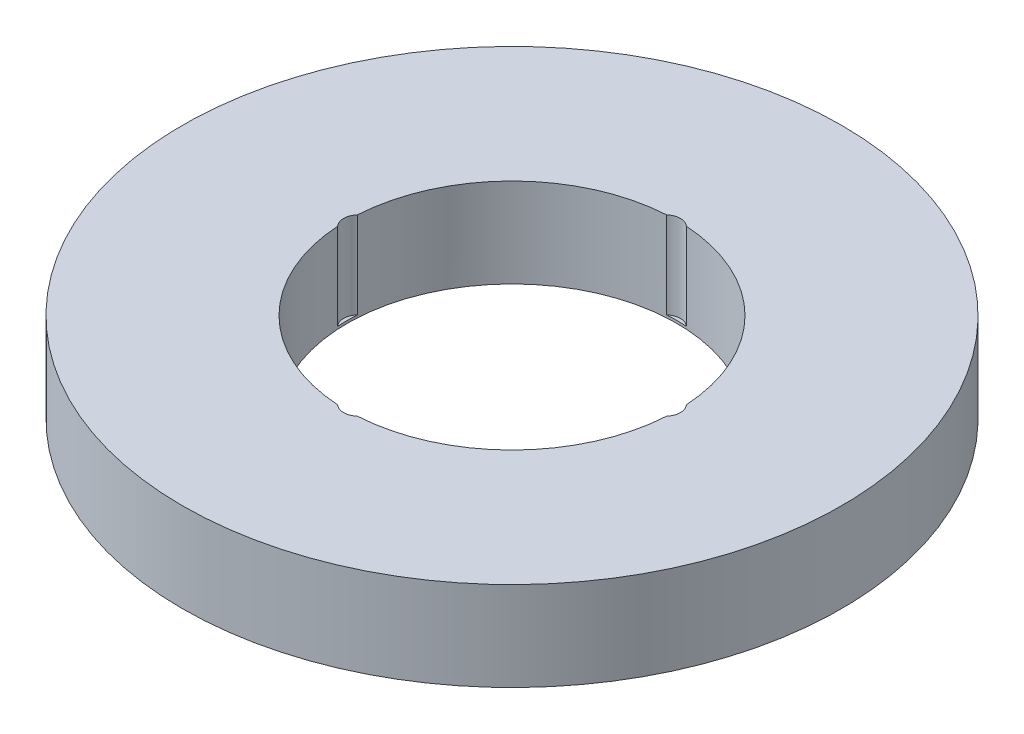
ISO-10303-21;
HEADER;
FILE_DESCRIPTION(('STEP AP214'),'2;1');
FILE_NAME('part.step','',(''),(''),'','','');
FILE_SCHEMA(('AUTOMOTIVE_DESIGN { 1 0 10303 214 1 1 1 1 }'));
ENDSEC;
DATA;
#1=APPLICATION_CONTEXT('core data for automotive mechanical design processes');
#2=APPLICATION_PROTOCOL_DEFINITION('international standard','automotive_design',2000,#1);
#3=PRODUCT_CONTEXT('',#1,'mechanical');
#4=PRODUCT('Part','Part','',(#3));
#5=PRODUCT_RELATED_PRODUCT_CATEGORY('part','',(#4));
#6=PRODUCT_DEFINITION_FORMATION('','',#4);
#7=PRODUCT_DEFINITION_CONTEXT('part definition',#1,'design');
#8=PRODUCT_DEFINITION('design','',#6,#7);
#9=PRODUCT_DEFINITION_SHAPE('','',#8);
#10=(LENGTH_UNIT() NAMED_UNIT(*) SI_UNIT(.MILLI.,.METRE.));
#11=(NAMED_UNIT(*) PLANE_ANGLE_UNIT() SI_UNIT($,.RADIAN.));
#12=(NAMED_UNIT(*) SI_UNIT($,.STERADIAN.) SOLID_ANGLE_UNIT());
#13=UNCERTAINTY_MEASURE_WITH_UNIT(LENGTH_MEASURE(1.E-05),#10,'distance_accuracy_value','');
#14=(GEOMETRIC_REPRESENTATION_CONTEXT(3) GLOBAL_UNCERTAINTY_ASSIGNED_CONTEXT((#13)) GLOBAL_UNIT_ASSIGNED_CONTEXT((#10,
#11,#12)) REPRESENTATION_CONTEXT('',''));
#15=CARTESIAN_POINT('',(0.,0.,0.));
#16=DIRECTION('',(0.,0.,1.));
#17=DIRECTION('',(1.,0.,0.));
#18=AXIS2_PLACEMENT_3D('',#15,#16,#17);
#19=CARTESIAN_POINT('',(0.,23.,0.));
#20=DIRECTION('',(0.,-1.,0.));
#21=DIRECTION('',(0.,0.,-1.));
#22=AXIS2_PLACEMENT_3D('',#19,#20,#21);
#23=CYLINDRICAL_SURFACE('',#22,85.);
#24=CARTESIAN_POINT('',(0.,23.,0.));
#25=DIRECTION('',(0.,1.,0.));
#26=DIRECTION('',(0.,0.,1.));
#27=AXIS2_PLACEMENT_3D('',#24,#25,#26);
#28=CIRCLE('',#27,85.);
#29=CARTESIAN_POINT('',(0.,23.,85.));
#30=VERTEX_POINT('',#29);
#31=EDGE_CURVE('E148',#30,#30,#28,.T.);
#32=ORIENTED_EDGE('',*,*,#31,.F.);
#33=EDGE_LOOP('',(#32));
#34=FACE_BOUND('',#33,.T.);
#35=CARTESIAN_POINT('',(0.,0.,0.));
#36=DIRECTION('',(0.,1.,0.));
#37=DIRECTION('',(0.,0.,1.));
#38=AXIS2_PLACEMENT_3D('',#35,#36,#37);
#39=CIRCLE('',#38,85.);
#40=CARTESIAN_POINT('',(0.,0.,85.));
#41=VERTEX_POINT('',#40);
#42=EDGE_CURVE('E139',#41,#41,#39,.T.);
#43=ORIENTED_EDGE('',*,*,#42,.T.);
#44=EDGE_LOOP('',(#43));
#45=FACE_BOUND('',#44,.T.);
#46=ADVANCED_FACE('F39',(#34,#45),#23,.T.);
#47=CARTESIAN_POINT('',(0.,23.,0.));
#48=DIRECTION('',(0.,1.,0.));
#49=DIRECTION('',(0.,0.,1.));
#50=AXIS2_PLACEMENT_3D('',#47,#48,#49);
#51=PLANE('',#50);
#52=CARTESIAN_POINT('',(1.38283452404793E-13,23.,39.605954889798));
#53=DIRECTION('',(0.,1.,0.));
#54=DIRECTION('',(1.,0.,0.));
#55=AXIS2_PLACEMENT_3D('',#52,#53,#54);
#56=CIRCLE('',#55,3.79896783425954);
#57=CARTESIAN_POINT('',(-2.54821095431487,23.,42.4235385244125));
#58=VERTEX_POINT('',#57);
#59=CARTESIAN_POINT('',(2.54821095431516,23.,42.4235385244125));
#60=VERTEX_POINT('',#59);
#61=EDGE_CURVE('E175',#58,#60,#56,.T.);
#62=ORIENTED_EDGE('',*,*,#61,.F.);
#63=CARTESIAN_POINT('',(0.,23.,0.));
#64=DIRECTION('',(0.,1.,0.));
#65=DIRECTION('',(0.,0.,1.));
#66=AXIS2_PLACEMENT_3D('',#63,#64,#65);
#67=CIRCLE('',#66,42.5);
#68=CARTESIAN_POINT('',(-42.4235385244125,23.,2.54821095431502));
#69=VERTEX_POINT('',#68);
#70=EDGE_CURVE('E134',#69,#58,#67,.T.);
#71=ORIENTED_EDGE('',*,*,#70,.F.);
#72=CARTESIAN_POINT('',(-39.605954889798,23.,0.));
#73=DIRECTION('',(0.,1.,0.));
#74=DIRECTION('',(0.,0.,1.));
#75=AXIS2_PLACEMENT_3D('',#72,#73,#74);
#76=CIRCLE('',#75,3.79896783425954);
#77=CARTESIAN_POINT('',(-42.4235385244125,23.,-2.54821095431502));
#78=VERTEX_POINT('',#77);
#79=EDGE_CURVE('E143',#78,#69,#76,.T.);
#80=ORIENTED_EDGE('',*,*,#79,.F.);
#81=CARTESIAN_POINT('',(-2.54821095431546,23.,-42.4235385244125));
#82=VERTEX_POINT('',#81);
#83=EDGE_CURVE('E123',#82,#78,#67,.T.);
#84=ORIENTED_EDGE('',*,*,#83,.F.);
#85=CARTESIAN_POINT('',(-4.14850357214378E-13,23.,-39.605954889798));
#86=DIRECTION('',(0.,1.,0.));
#87=DIRECTION('',(-1.,0.,0.));
#88=AXIS2_PLACEMENT_3D('',#85,#86,#87);
#89=CIRCLE('',#88,3.79896783425954);
#90=CARTESIAN_POINT('',(2.54821095431457,23.,-42.4235385244125));
#91=VERTEX_POINT('',#90);
#92=EDGE_CURVE('E106',#91,#82,#89,.T.);
#93=ORIENTED_EDGE('',*,*,#92,.F.);
#94=CARTESIAN_POINT('',(42.4235385244125,23.,-2.54821095431502));
#95=VERTEX_POINT('',#94);
#96=EDGE_CURVE('E125',#95,#91,#67,.T.);
#97=ORIENTED_EDGE('',*,*,#96,.F.);
#98=CARTESIAN_POINT('',(39.605954889798,23.,0.));
#99=DIRECTION('',(0.,1.,0.));
#100=DIRECTION('',(0.,0.,-1.));
#101=AXIS2_PLACEMENT_3D('',#98,#99,#100);
#102=CIRCLE('',#101,3.79896783425954);
#103=CARTESIAN_POINT('',(42.4235385244125,23.,2.54821095431502));
#104=VERTEX_POINT('',#103);
#105=EDGE_CURVE('E286',#104,#95,#102,.T.);
#106=ORIENTED_EDGE('',*,*,#105,.F.);
#107=EDGE_CURVE('E135',#60,#104,#67,.T.);
#108=ORIENTED_EDGE('',*,*,#107,.F.);
#109=EDGE_LOOP('',(#62,#71,#80,#84,#93,#97,#106,#108));
#110=FACE_BOUND('',#109,.T.);
#111=ORIENTED_EDGE('',*,*,#31,.T.);
#112=EDGE_LOOP('',(#111));
#113=FACE_BOUND('',#112,.T.);
#114=ADVANCED_FACE('F118',(#110,#113),#51,.T.);
#115=CARTESIAN_POINT('',(0.,0.,0.));
#116=DIRECTION('',(0.,1.,0.));
#117=DIRECTION('',(0.,0.,1.));
#118=AXIS2_PLACEMENT_3D('',#115,#116,#117);
#119=PLANE('',#118);
#120=CARTESIAN_POINT('',(0.,0.,0.));
#121=DIRECTION('',(0.,1.,0.));
#122=DIRECTION('',(0.,0.,1.));
#123=AXIS2_PLACEMENT_3D('',#120,#121,#122);
#124=CIRCLE('',#123,42.5);
#125=CARTESIAN_POINT('',(0.,0.,42.5));
#126=VERTEX_POINT('',#125);
#127=EDGE_CURVE('E136',#126,#126,#124,.T.);
#128=ORIENTED_EDGE('',*,*,#127,.T.);
#129=EDGE_LOOP('',(#128));
#130=FACE_BOUND('',#129,.T.);
#131=ORIENTED_EDGE('',*,*,#42,.F.);
#132=EDGE_LOOP('',(#131));
#133=FACE_BOUND('',#132,.T.);
#134=ADVANCED_FACE('F187',(#130,#133),#119,.F.);
#135=CARTESIAN_POINT('',(0.,23.,0.));
#136=DIRECTION('',(0.,-1.,0.));
#137=DIRECTION('',(0.,0.,-1.));
#138=AXIS2_PLACEMENT_3D('',#135,#136,#137);
#139=CYLINDRICAL_SURFACE('',#138,42.5);
#140=DIRECTION('',(0.,1.,0.));
#141=VECTOR('',#140,1.);
#142=CARTESIAN_POINT('',(-2.54821095431485,11.828863973427,42.4235385244125));
#143=LINE('',#142,#141);
#144=CARTESIAN_POINT('',(-2.54821095431487,0.657727946853988,42.4235385244125));
#145=VERTEX_POINT('',#144);
#146=EDGE_CURVE('E11',#145,#58,#143,.T.);
#147=ORIENTED_EDGE('',*,*,#146,.F.);
#148=CARTESIAN_POINT('',(0.,0.657727946853988,0.));
#149=DIRECTION('',(0.,1.,0.));
#150=DIRECTION('',(0.,0.,1.));
#151=AXIS2_PLACEMENT_3D('',#148,#149,#150);
#152=CIRCLE('',#151,42.5);
#153=CARTESIAN_POINT('',(2.54821095431516,0.657727946853988,42.4235385244125));
#154=VERTEX_POINT('',#153);
#155=EDGE_CURVE('E170',#145,#154,#152,.T.);
#156=ORIENTED_EDGE('',*,*,#155,.T.);
#157=DIRECTION('',(0.,1.,0.));
#158=VECTOR('',#157,1.);
#159=CARTESIAN_POINT('',(2.54821095431514,11.828863973427,42.4235385244125));
#160=LINE('',#159,#158);
#161=EDGE_CURVE('E46',#60,#154,#160,.F.);
#162=ORIENTED_EDGE('',*,*,#161,.F.);
#163=ORIENTED_EDGE('',*,*,#107,.T.);
#164=DIRECTION('',(0.,1.,0.));
#165=VECTOR('',#164,1.);
#166=CARTESIAN_POINT('',(42.4235385244125,11.828863973427,2.548210954315));
#167=LINE('',#166,#165);
#168=CARTESIAN_POINT('',(42.4235385244125,0.657727946853988,2.54821095431502));
#169=VERTEX_POINT('',#168);
#170=EDGE_CURVE('E164',#169,#104,#167,.T.);
#171=ORIENTED_EDGE('',*,*,#170,.F.);
#172=CARTESIAN_POINT('',(0.,0.657727946853988,0.));
#173=DIRECTION('',(0.,1.,0.));
#174=DIRECTION('',(0.,0.,1.));
#175=AXIS2_PLACEMENT_3D('',#172,#173,#174);
#176=CIRCLE('',#175,42.5);
#177=CARTESIAN_POINT('',(42.4235385244125,0.657727946853988,-2.54821095431502));
#178=VERTEX_POINT('',#177);
#179=EDGE_CURVE('E115',#169,#178,#176,.T.);
#180=ORIENTED_EDGE('',*,*,#179,.T.);
#181=DIRECTION('',(0.,1.,0.));
#182=VECTOR('',#181,1.);
#183=CARTESIAN_POINT('',(42.4235385244125,11.828863973427,-2.548210954315));
#184=LINE('',#183,#182);
#185=EDGE_CURVE('E131',#95,#178,#184,.F.);
#186=ORIENTED_EDGE('',*,*,#185,.F.);
#187=ORIENTED_EDGE('',*,*,#96,.T.);
#188=DIRECTION('',(0.,1.,0.));
#189=VECTOR('',#188,1.);
#190=CARTESIAN_POINT('',(2.54821095431455,11.828863973427,-42.4235385244125));
#191=LINE('',#190,#189);
#192=CARTESIAN_POINT('',(2.54821095431457,0.657727946853988,-42.4235385244125));
#193=VERTEX_POINT('',#192);
#194=EDGE_CURVE('E105',#193,#91,#191,.T.);
#195=ORIENTED_EDGE('',*,*,#194,.F.);
#196=CARTESIAN_POINT('',(0.,0.657727946853988,0.));
#197=DIRECTION('',(0.,1.,0.));
#198=DIRECTION('',(0.,0.,1.));
#199=AXIS2_PLACEMENT_3D('',#196,#197,#198);
#200=CIRCLE('',#199,42.5);
#201=CARTESIAN_POINT('',(-2.54821095431546,0.657727946853988,-42.4235385244125));
#202=VERTEX_POINT('',#201);
#203=EDGE_CURVE('E159',#193,#202,#200,.T.);
#204=ORIENTED_EDGE('',*,*,#203,.T.);
#205=DIRECTION('',(0.,1.,0.));
#206=VECTOR('',#205,1.);
#207=CARTESIAN_POINT('',(-2.54821095431544,11.828863973427,-42.4235385244125));
#208=LINE('',#207,#206);
#209=EDGE_CURVE('E114',#82,#202,#208,.F.);
#210=ORIENTED_EDGE('',*,*,#209,.F.);
#211=ORIENTED_EDGE('',*,*,#83,.T.);
#212=DIRECTION('',(0.,1.,0.));
#213=VECTOR('',#212,1.);
#214=CARTESIAN_POINT('',(-42.4235385244125,11.828863973427,-2.548210954315));
#215=LINE('',#214,#213);
#216=CARTESIAN_POINT('',(-42.4235385244125,0.657727946853988,-2.54821095431502));
#217=VERTEX_POINT('',#216);
#218=EDGE_CURVE('E160',#217,#78,#215,.T.);
#219=ORIENTED_EDGE('',*,*,#218,.F.);
#220=CARTESIAN_POINT('',(0.,0.657727946853988,0.));
#221=DIRECTION('',(0.,1.,0.));
#222=DIRECTION('',(0.,0.,1.));
#223=AXIS2_PLACEMENT_3D('',#220,#221,#222);
#224=CIRCLE('',#223,42.5);
#225=CARTESIAN_POINT('',(-42.4235385244125,0.657727946853988,2.54821095431502));
#226=VERTEX_POINT('',#225);
#227=EDGE_CURVE('E149',#217,#226,#224,.T.);
#228=ORIENTED_EDGE('',*,*,#227,.T.);
#229=DIRECTION('',(0.,1.,0.));
#230=VECTOR('',#229,1.);
#231=CARTESIAN_POINT('',(-42.4235385244125,11.828863973427,2.548210954315));
#232=LINE('',#231,#230);
#233=EDGE_CURVE('E152',#69,#226,#232,.F.);
#234=ORIENTED_EDGE('',*,*,#233,.F.);
#235=ORIENTED_EDGE('',*,*,#70,.T.);
#236=EDGE_LOOP('',(#147,#156,#162,#163,#171,#180,#186,#187,#195,#204,#210,#211,#219,#228,#234,#235));
#237=FACE_BOUND('',#236,.T.);
#238=ORIENTED_EDGE('',*,*,#127,.F.);
#239=EDGE_LOOP('',(#238));
#240=FACE_BOUND('',#239,.T.);
#241=ADVANCED_FACE('F126',(#237,#240),#139,.F.);
#242=CARTESIAN_POINT('',(-39.605954889798,0.657727946853988,0.));
#243=DIRECTION('',(0.,1.,0.));
#244=DIRECTION('',(0.,0.,1.));
#245=AXIS2_PLACEMENT_3D('',#242,#243,#244);
#246=CYLINDRICAL_SURFACE('',#245,3.79896783425954);
#247=ORIENTED_EDGE('',*,*,#218,.T.);
#248=ORIENTED_EDGE('',*,*,#79,.T.);
#249=ORIENTED_EDGE('',*,*,#233,.T.);
#250=CARTESIAN_POINT('',(-39.605954889798,0.657727946853988,0.));
#251=DIRECTION('',(0.,1.,0.));
#252=DIRECTION('',(0.,0.,1.));
#253=AXIS2_PLACEMENT_3D('',#250,#251,#252);
#254=CIRCLE('',#253,3.79896783425954);
#255=EDGE_CURVE('E144',#217,#226,#254,.T.);
#256=ORIENTED_EDGE('',*,*,#255,.F.);
#257=EDGE_LOOP('',(#247,#248,#249,#256));
#258=FACE_BOUND('',#257,.T.);
#259=ADVANCED_FACE('F200',(#258),#246,.F.);
#260=CARTESIAN_POINT('',(-39.605954889798,0.657727946853988,0.));
#261=DIRECTION('',(0.,1.,0.));
#262=DIRECTION('',(0.,0.,1.));
#263=AXIS2_PLACEMENT_3D('',#260,#261,#262);
#264=PLANE('',#263);
#265=ORIENTED_EDGE('',*,*,#255,.T.);
#266=ORIENTED_EDGE('',*,*,#227,.F.);
#267=EDGE_LOOP('',(#265,#266));
#268=FACE_BOUND('',#267,.T.);
#269=ADVANCED_FACE('F201',(#268),#264,.T.);
#270=CARTESIAN_POINT('',(-4.14850357214378E-13,0.657727946853988,-39.605954889798));
#271=DIRECTION('',(0.,1.,0.));
#272=DIRECTION('',(0.,0.,1.));
#273=AXIS2_PLACEMENT_3D('',#270,#271,#272);
#274=CYLINDRICAL_SURFACE('',#273,3.79896783425954);
#275=ORIENTED_EDGE('',*,*,#194,.T.);
#276=ORIENTED_EDGE('',*,*,#92,.T.);
#277=ORIENTED_EDGE('',*,*,#209,.T.);
#278=CARTESIAN_POINT('',(-4.14850357214378E-13,0.657727946853988,-39.605954889798));
#279=DIRECTION('',(0.,1.,0.));
#280=DIRECTION('',(-1.,0.,0.));
#281=AXIS2_PLACEMENT_3D('',#278,#279,#280);
#282=CIRCLE('',#281,3.79896783425954);
#283=EDGE_CURVE('E107',#193,#202,#282,.T.);
#284=ORIENTED_EDGE('',*,*,#283,.F.);
#285=EDGE_LOOP('',(#275,#276,#277,#284));
#286=FACE_BOUND('',#285,.T.);
#287=ADVANCED_FACE('F102',(#286),#274,.F.);
#288=CARTESIAN_POINT('',(-4.14850357214378E-13,0.657727946853988,-39.605954889798));
#289=DIRECTION('',(0.,1.,0.));
#290=DIRECTION('',(-1.,0.,0.));
#291=AXIS2_PLACEMENT_3D('',#288,#289,#290);
#292=PLANE('',#291);
#293=ORIENTED_EDGE('',*,*,#283,.T.);
#294=ORIENTED_EDGE('',*,*,#203,.F.);
#295=EDGE_LOOP('',(#293,#294));
#296=FACE_BOUND('',#295,.T.);
#297=ADVANCED_FACE('F209',(#296),#292,.T.);
#298=CARTESIAN_POINT('',(39.605954889798,0.657727946853988,0.));
#299=DIRECTION('',(0.,1.,0.));
#300=DIRECTION('',(0.,0.,1.));
#301=AXIS2_PLACEMENT_3D('',#298,#299,#300);
#302=CYLINDRICAL_SURFACE('',#301,3.79896783425954);
#303=ORIENTED_EDGE('',*,*,#170,.T.);
#304=ORIENTED_EDGE('',*,*,#105,.T.);
#305=ORIENTED_EDGE('',*,*,#185,.T.);
#306=CARTESIAN_POINT('',(39.605954889798,0.657727946853988,0.));
#307=DIRECTION('',(0.,1.,0.));
#308=DIRECTION('',(0.,0.,-1.));
#309=AXIS2_PLACEMENT_3D('',#306,#307,#308);
#310=CIRCLE('',#309,3.79896783425954);
#311=EDGE_CURVE('E56',#169,#178,#310,.T.);
#312=ORIENTED_EDGE('',*,*,#311,.F.);
#313=EDGE_LOOP('',(#303,#304,#305,#312));
#314=FACE_BOUND('',#313,.T.);
#315=ADVANCED_FACE('F213',(#314),#302,.F.);
#316=CARTESIAN_POINT('',(39.605954889798,0.657727946853988,0.));
#317=DIRECTION('',(0.,1.,0.));
#318=DIRECTION('',(0.,0.,-1.));
#319=AXIS2_PLACEMENT_3D('',#316,#317,#318);
#320=PLANE('',#319);
#321=ORIENTED_EDGE('',*,*,#311,.T.);
#322=ORIENTED_EDGE('',*,*,#179,.F.);
#323=EDGE_LOOP('',(#321,#322));
#324=FACE_BOUND('',#323,.T.);
#325=ADVANCED_FACE('F179',(#324),#320,.T.);
#326=CARTESIAN_POINT('',(1.38283452404793E-13,0.657727946853988,39.605954889798));
#327=DIRECTION('',(0.,1.,0.));
#328=DIRECTION('',(0.,0.,1.));
#329=AXIS2_PLACEMENT_3D('',#326,#327,#328);
#330=CYLINDRICAL_SURFACE('',#329,3.79896783425954);
#331=ORIENTED_EDGE('',*,*,#146,.T.);
#332=ORIENTED_EDGE('',*,*,#61,.T.);
#333=ORIENTED_EDGE('',*,*,#161,.T.);
#334=CARTESIAN_POINT('',(1.38283452404793E-13,0.657727946853988,39.605954889798));
#335=DIRECTION('',(0.,1.,0.));
#336=DIRECTION('',(1.,0.,0.));
#337=AXIS2_PLACEMENT_3D('',#334,#335,#336);
#338=CIRCLE('',#337,3.79896783425954);
#339=EDGE_CURVE('E55',#145,#154,#338,.T.);
#340=ORIENTED_EDGE('',*,*,#339,.F.);
#341=EDGE_LOOP('',(#331,#332,#333,#340));
#342=FACE_BOUND('',#341,.T.);
#343=ADVANCED_FACE('F171',(#342),#330,.F.);
#344=CARTESIAN_POINT('',(1.38283452404793E-13,0.657727946853988,39.605954889798));
#345=DIRECTION('',(0.,1.,0.));
#346=DIRECTION('',(1.,0.,0.));
#347=AXIS2_PLACEMENT_3D('',#344,#345,#346);
#348=PLANE('',#347);
#349=ORIENTED_EDGE('',*,*,#339,.T.);
#350=ORIENTED_EDGE('',*,*,#155,.F.);
#351=EDGE_LOOP('',(#349,#350));
#352=FACE_BOUND('',#351,.T.);
#353=ADVANCED_FACE('F173',(#352),#348,.T.);
#354=CLOSED_SHELL('',(#46,#114,#134,#241,#259,#269,#287,#297,#315,#325,#343,#353));
#355=MANIFOLD_SOLID_BREP('B2',#354);
#356=ADVANCED_BREP_SHAPE_REPRESENTATION('',(#18,#355),#14);
#357=SHAPE_DEFINITION_REPRESENTATION(#9,#356);
ENDSEC;
END-ISO-10303-21;
